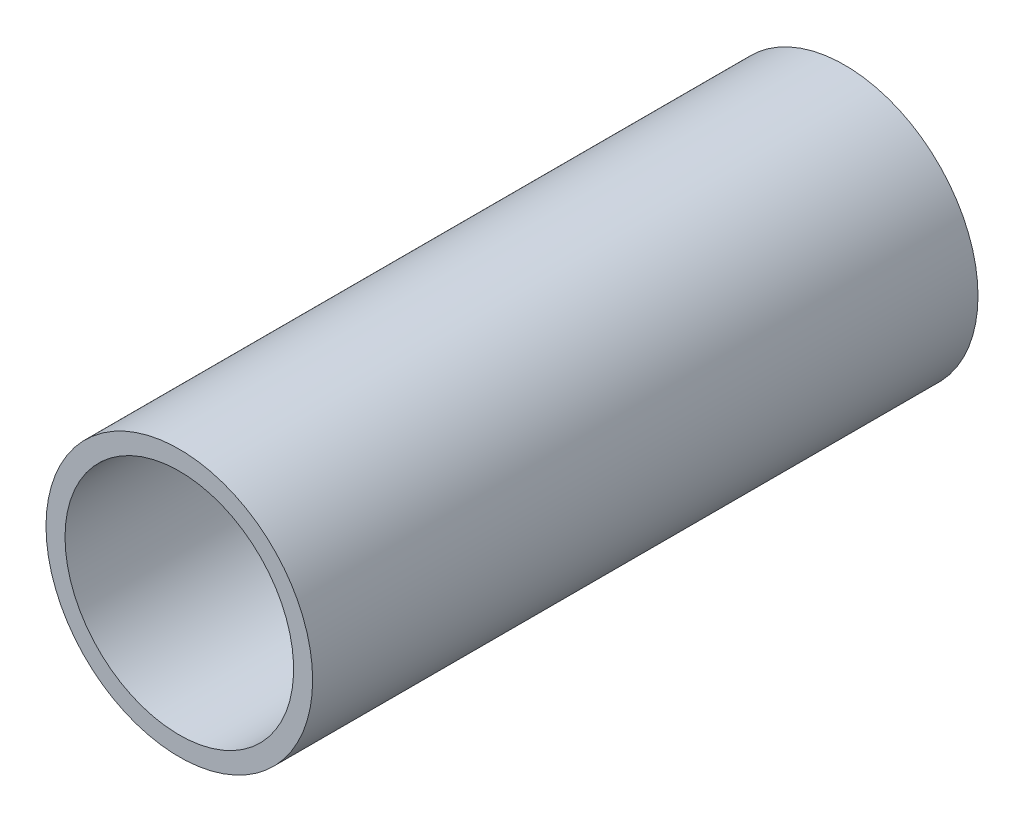
ISO-10303-21;
HEADER;
FILE_DESCRIPTION(('STEP AP214'),'2;1');
FILE_NAME('part.step','',(''),(''),'','','');
FILE_SCHEMA(('AUTOMOTIVE_DESIGN { 1 0 10303 214 1 1 1 1 }'));
ENDSEC;
DATA;
#1=APPLICATION_CONTEXT('core data for automotive mechanical design processes');
#2=APPLICATION_PROTOCOL_DEFINITION('international standard','automotive_design',2000,#1);
#3=PRODUCT_CONTEXT('',#1,'mechanical');
#4=PRODUCT('Part','Part','',(#3));
#5=PRODUCT_RELATED_PRODUCT_CATEGORY('part','',(#4));
#6=PRODUCT_DEFINITION_FORMATION('','',#4);
#7=PRODUCT_DEFINITION_CONTEXT('part definition',#1,'design');
#8=PRODUCT_DEFINITION('design','',#6,#7);
#9=PRODUCT_DEFINITION_SHAPE('','',#8);
#10=(LENGTH_UNIT() NAMED_UNIT(*) SI_UNIT(.MILLI.,.METRE.));
#11=(NAMED_UNIT(*) PLANE_ANGLE_UNIT() SI_UNIT($,.RADIAN.));
#12=(NAMED_UNIT(*) SI_UNIT($,.STERADIAN.) SOLID_ANGLE_UNIT());
#13=UNCERTAINTY_MEASURE_WITH_UNIT(LENGTH_MEASURE(1.E-05),#10,'distance_accuracy_value','');
#14=(GEOMETRIC_REPRESENTATION_CONTEXT(3) GLOBAL_UNCERTAINTY_ASSIGNED_CONTEXT((#13)) GLOBAL_UNIT_ASSIGNED_CONTEXT((#10,
#11,#12)) REPRESENTATION_CONTEXT('',''));
#15=CARTESIAN_POINT('',(0.,0.,0.));
#16=DIRECTION('',(0.,0.,1.));
#17=DIRECTION('',(1.,0.,0.));
#18=AXIS2_PLACEMENT_3D('',#15,#16,#17);
#19=CARTESIAN_POINT('',(0.,0.,0.));
#20=DIRECTION('',(0.,0.,-1.));
#21=DIRECTION('',(-1.,0.,0.));
#22=AXIS2_PLACEMENT_3D('',#19,#20,#21);
#23=CYLINDRICAL_SURFACE('',#22,38.18);
#24=CARTESIAN_POINT('',(0.,0.,0.));
#25=DIRECTION('',(0.,0.,-1.));
#26=DIRECTION('',(-1.,0.,0.));
#27=AXIS2_PLACEMENT_3D('',#24,#25,#26);
#28=CIRCLE('',#27,38.18);
#29=CARTESIAN_POINT('',(-38.18,0.,0.));
#30=VERTEX_POINT('',#29);
#31=EDGE_CURVE('E65',#30,#30,#28,.T.);
#32=ORIENTED_EDGE('',*,*,#31,.F.);
#33=EDGE_LOOP('',(#32));
#34=FACE_BOUND('',#33,.T.);
#35=CARTESIAN_POINT('',(0.,0.,-222.25));
#36=DIRECTION('',(0.,0.,-1.));
#37=DIRECTION('',(-1.,0.,0.));
#38=AXIS2_PLACEMENT_3D('',#35,#36,#37);
#39=CIRCLE('',#38,38.18);
#40=CARTESIAN_POINT('',(-38.18,0.,-222.25));
#41=VERTEX_POINT('',#40);
#42=EDGE_CURVE('E10',#41,#41,#39,.T.);
#43=ORIENTED_EDGE('',*,*,#42,.T.);
#44=EDGE_LOOP('',(#43));
#45=FACE_BOUND('',#44,.T.);
#46=ADVANCED_FACE('F47',(#34,#45),#23,.F.);
#47=CARTESIAN_POINT('',(38.18,0.,-222.25));
#48=DIRECTION('',(0.,0.,1.));
#49=DIRECTION('',(1.,0.,0.));
#50=AXIS2_PLACEMENT_3D('',#47,#48,#49);
#51=PLANE('',#50);
#52=ORIENTED_EDGE('',*,*,#42,.F.);
#53=EDGE_LOOP('',(#52));
#54=FACE_BOUND('',#53,.T.);
#55=CARTESIAN_POINT('',(0.,0.,-222.25));
#56=DIRECTION('',(0.,0.,-1.));
#57=DIRECTION('',(-1.,0.,0.));
#58=AXIS2_PLACEMENT_3D('',#55,#56,#57);
#59=CIRCLE('',#58,44.53);
#60=CARTESIAN_POINT('',(-44.53,0.,-222.25));
#61=VERTEX_POINT('',#60);
#62=EDGE_CURVE('E54',#61,#61,#59,.T.);
#63=ORIENTED_EDGE('',*,*,#62,.T.);
#64=EDGE_LOOP('',(#63));
#65=FACE_BOUND('',#64,.T.);
#66=ADVANCED_FACE('F74',(#54,#65),#51,.F.);
#67=CARTESIAN_POINT('',(0.,0.,0.));
#68=DIRECTION('',(0.,0.,-1.));
#69=DIRECTION('',(-1.,0.,0.));
#70=AXIS2_PLACEMENT_3D('',#67,#68,#69);
#71=CYLINDRICAL_SURFACE('',#70,44.53);
#72=ORIENTED_EDGE('',*,*,#62,.F.);
#73=EDGE_LOOP('',(#72));
#74=FACE_BOUND('',#73,.T.);
#75=CARTESIAN_POINT('',(0.,0.,0.));
#76=DIRECTION('',(0.,0.,-1.));
#77=DIRECTION('',(-1.,0.,0.));
#78=AXIS2_PLACEMENT_3D('',#75,#76,#77);
#79=CIRCLE('',#78,44.53);
#80=CARTESIAN_POINT('',(-44.53,0.,0.));
#81=VERTEX_POINT('',#80);
#82=EDGE_CURVE('E61',#81,#81,#79,.T.);
#83=ORIENTED_EDGE('',*,*,#82,.T.);
#84=EDGE_LOOP('',(#83));
#85=FACE_BOUND('',#84,.T.);
#86=ADVANCED_FACE('F78',(#74,#85),#71,.T.);
#87=CARTESIAN_POINT('',(38.18,0.,0.));
#88=DIRECTION('',(0.,0.,-1.));
#89=DIRECTION('',(-1.,0.,0.));
#90=AXIS2_PLACEMENT_3D('',#87,#88,#89);
#91=PLANE('',#90);
#92=ORIENTED_EDGE('',*,*,#82,.F.);
#93=EDGE_LOOP('',(#92));
#94=FACE_BOUND('',#93,.T.);
#95=ORIENTED_EDGE('',*,*,#31,.T.);
#96=EDGE_LOOP('',(#95));
#97=FACE_BOUND('',#96,.T.);
#98=ADVANCED_FACE('F71',(#94,#97),#91,.F.);
#99=CLOSED_SHELL('',(#46,#66,#86,#98));
#100=MANIFOLD_SOLID_BREP('B2',#99);
#101=ADVANCED_BREP_SHAPE_REPRESENTATION('',(#18,#100),#14);
#102=SHAPE_DEFINITION_REPRESENTATION(#9,#101);
ENDSEC;
END-ISO-10303-21;
